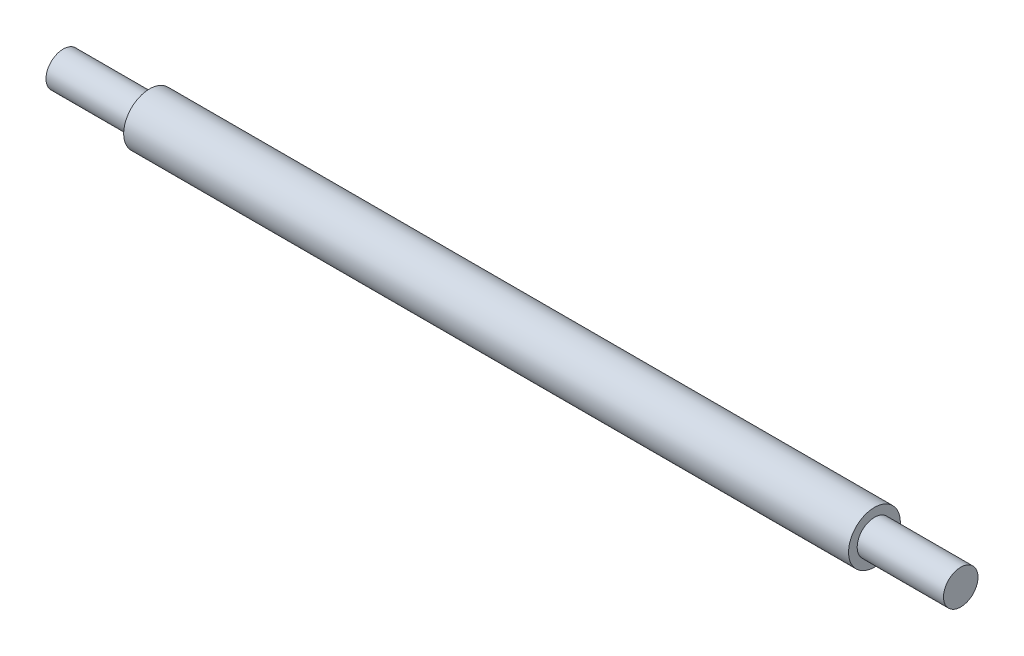
ISO-10303-21;
HEADER;
FILE_DESCRIPTION(('STEP AP214'),'2;1');
FILE_NAME('part.step','',(''),(''),'','','');
FILE_SCHEMA(('AUTOMOTIVE_DESIGN { 1 0 10303 214 1 1 1 1 }'));
ENDSEC;
DATA;
#1=APPLICATION_CONTEXT('core data for automotive mechanical design processes');
#2=APPLICATION_PROTOCOL_DEFINITION('international standard','automotive_design',2000,#1);
#3=PRODUCT_CONTEXT('',#1,'mechanical');
#4=PRODUCT('Part','Part','',(#3));
#5=PRODUCT_RELATED_PRODUCT_CATEGORY('part','',(#4));
#6=PRODUCT_DEFINITION_FORMATION('','',#4);
#7=PRODUCT_DEFINITION_CONTEXT('part definition',#1,'design');
#8=PRODUCT_DEFINITION('design','',#6,#7);
#9=PRODUCT_DEFINITION_SHAPE('','',#8);
#10=(LENGTH_UNIT() NAMED_UNIT(*) SI_UNIT(.MILLI.,.METRE.));
#11=(NAMED_UNIT(*) PLANE_ANGLE_UNIT() SI_UNIT($,.RADIAN.));
#12=(NAMED_UNIT(*) SI_UNIT($,.STERADIAN.) SOLID_ANGLE_UNIT());
#13=UNCERTAINTY_MEASURE_WITH_UNIT(LENGTH_MEASURE(1.E-05),#10,'distance_accuracy_value','');
#14=(GEOMETRIC_REPRESENTATION_CONTEXT(3) GLOBAL_UNCERTAINTY_ASSIGNED_CONTEXT((#13)) GLOBAL_UNIT_ASSIGNED_CONTEXT((#10,
#11,#12)) REPRESENTATION_CONTEXT('',''));
#15=CARTESIAN_POINT('',(0.,0.,0.));
#16=DIRECTION('',(0.,0.,1.));
#17=DIRECTION('',(1.,0.,0.));
#18=AXIS2_PLACEMENT_3D('',#15,#16,#17);
#19=CARTESIAN_POINT('',(-52.,0.,0.));
#20=DIRECTION('',(1.,0.,0.));
#21=DIRECTION('',(0.,1.,0.));
#22=AXIS2_PLACEMENT_3D('',#19,#20,#21);
#23=PLANE('',#22);
#24=CARTESIAN_POINT('',(-52.,0.,0.));
#25=DIRECTION('',(-1.,0.,0.));
#26=DIRECTION('',(0.,-1.,0.));
#27=AXIS2_PLACEMENT_3D('',#24,#25,#26);
#28=CIRCLE('',#27,2.);
#29=CARTESIAN_POINT('',(-52.,-2.00000000000002,0.));
#30=VERTEX_POINT('',#29);
#31=EDGE_CURVE('E10',#30,#30,#28,.T.);
#32=ORIENTED_EDGE('',*,*,#31,.T.);
#33=EDGE_LOOP('',(#32));
#34=FACE_BOUND('',#33,.T.);
#35=ADVANCED_FACE('F29',(#34),#23,.F.);
#36=CARTESIAN_POINT('',(-52.,0.,0.));
#37=DIRECTION('',(-1.,0.,0.));
#38=DIRECTION('',(0.,-1.,0.));
#39=AXIS2_PLACEMENT_3D('',#36,#37,#38);
#40=CYLINDRICAL_SURFACE('',#39,2.);
#41=ORIENTED_EDGE('',*,*,#31,.F.);
#42=EDGE_LOOP('',(#41));
#43=FACE_BOUND('',#42,.T.);
#44=CARTESIAN_POINT('',(-42.,0.,0.));
#45=DIRECTION('',(-1.,0.,0.));
#46=DIRECTION('',(0.,-1.,0.));
#47=AXIS2_PLACEMENT_3D('',#44,#45,#46);
#48=CIRCLE('',#47,2.);
#49=CARTESIAN_POINT('',(-42.,-2.00000000000002,0.));
#50=VERTEX_POINT('',#49);
#51=EDGE_CURVE('E35',#50,#50,#48,.T.);
#52=ORIENTED_EDGE('',*,*,#51,.T.);
#53=EDGE_LOOP('',(#52));
#54=FACE_BOUND('',#53,.T.);
#55=ADVANCED_FACE('F67',(#43,#54),#40,.T.);
#56=CARTESIAN_POINT('',(-42.,1.99999999999999,0.));
#57=DIRECTION('',(1.,0.,0.));
#58=DIRECTION('',(0.,1.,0.));
#59=AXIS2_PLACEMENT_3D('',#56,#57,#58);
#60=PLANE('',#59);
#61=ORIENTED_EDGE('',*,*,#51,.F.);
#62=EDGE_LOOP('',(#61));
#63=FACE_BOUND('',#62,.T.);
#64=CARTESIAN_POINT('',(-42.,0.,0.));
#65=DIRECTION('',(-1.,0.,0.));
#66=DIRECTION('',(0.,-1.,0.));
#67=AXIS2_PLACEMENT_3D('',#64,#65,#66);
#68=CIRCLE('',#67,3.);
#69=CARTESIAN_POINT('',(-42.,-3.00000000000002,0.));
#70=VERTEX_POINT('',#69);
#71=EDGE_CURVE('E39',#70,#70,#68,.T.);
#72=ORIENTED_EDGE('',*,*,#71,.T.);
#73=EDGE_LOOP('',(#72));
#74=FACE_BOUND('',#73,.T.);
#75=ADVANCED_FACE('F71',(#63,#74),#60,.F.);
#76=CARTESIAN_POINT('',(-52.,0.,0.));
#77=DIRECTION('',(-1.,0.,0.));
#78=DIRECTION('',(0.,-1.,0.));
#79=AXIS2_PLACEMENT_3D('',#76,#77,#78);
#80=CYLINDRICAL_SURFACE('',#79,3.);
#81=ORIENTED_EDGE('',*,*,#71,.F.);
#82=EDGE_LOOP('',(#81));
#83=FACE_BOUND('',#82,.T.);
#84=CARTESIAN_POINT('',(42.,0.,0.));
#85=DIRECTION('',(-1.,0.,0.));
#86=DIRECTION('',(0.,-1.,0.));
#87=AXIS2_PLACEMENT_3D('',#84,#85,#86);
#88=CIRCLE('',#87,3.);
#89=CARTESIAN_POINT('',(42.,-3.00000000000001,0.));
#90=VERTEX_POINT('',#89);
#91=EDGE_CURVE('E43',#90,#90,#88,.T.);
#92=ORIENTED_EDGE('',*,*,#91,.T.);
#93=EDGE_LOOP('',(#92));
#94=FACE_BOUND('',#93,.T.);
#95=ADVANCED_FACE('F76',(#83,#94),#80,.T.);
#96=CARTESIAN_POINT('',(42.,2.99999999999999,0.));
#97=DIRECTION('',(-1.,0.,0.));
#98=DIRECTION('',(0.,-1.,0.));
#99=AXIS2_PLACEMENT_3D('',#96,#97,#98);
#100=PLANE('',#99);
#101=ORIENTED_EDGE('',*,*,#91,.F.);
#102=EDGE_LOOP('',(#101));
#103=FACE_BOUND('',#102,.T.);
#104=CARTESIAN_POINT('',(42.,0.,0.));
#105=DIRECTION('',(-1.,0.,0.));
#106=DIRECTION('',(0.,-1.,0.));
#107=AXIS2_PLACEMENT_3D('',#104,#105,#106);
#108=CIRCLE('',#107,2.);
#109=CARTESIAN_POINT('',(42.,-2.00000000000001,0.));
#110=VERTEX_POINT('',#109);
#111=EDGE_CURVE('E48',#110,#110,#108,.T.);
#112=ORIENTED_EDGE('',*,*,#111,.T.);
#113=EDGE_LOOP('',(#112));
#114=FACE_BOUND('',#113,.T.);
#115=ADVANCED_FACE('F63',(#103,#114),#100,.F.);
#116=CARTESIAN_POINT('',(-52.,0.,0.));
#117=DIRECTION('',(-1.,0.,0.));
#118=DIRECTION('',(0.,-1.,0.));
#119=AXIS2_PLACEMENT_3D('',#116,#117,#118);
#120=CYLINDRICAL_SURFACE('',#119,2.);
#121=ORIENTED_EDGE('',*,*,#111,.F.);
#122=EDGE_LOOP('',(#121));
#123=FACE_BOUND('',#122,.T.);
#124=CARTESIAN_POINT('',(52.,0.,0.));
#125=DIRECTION('',(-1.,0.,0.));
#126=DIRECTION('',(0.,-1.,0.));
#127=AXIS2_PLACEMENT_3D('',#124,#125,#126);
#128=CIRCLE('',#127,2.);
#129=CARTESIAN_POINT('',(52.,-2.00000000000001,0.));
#130=VERTEX_POINT('',#129);
#131=EDGE_CURVE('E51',#130,#130,#128,.T.);
#132=ORIENTED_EDGE('',*,*,#131,.T.);
#133=EDGE_LOOP('',(#132));
#134=FACE_BOUND('',#133,.T.);
#135=ADVANCED_FACE('F55',(#123,#134),#120,.T.);
#136=CARTESIAN_POINT('',(52.,1.99999999999999,0.));
#137=DIRECTION('',(-1.,0.,0.));
#138=DIRECTION('',(0.,-1.,0.));
#139=AXIS2_PLACEMENT_3D('',#136,#137,#138);
#140=PLANE('',#139);
#141=ORIENTED_EDGE('',*,*,#131,.F.);
#142=EDGE_LOOP('',(#141));
#143=FACE_BOUND('',#142,.T.);
#144=ADVANCED_FACE('F57',(#143),#140,.F.);
#145=CLOSED_SHELL('',(#35,#55,#75,#95,#115,#135,#144));
#146=MANIFOLD_SOLID_BREP('B2',#145);
#147=ADVANCED_BREP_SHAPE_REPRESENTATION('',(#18,#146),#14);
#148=SHAPE_DEFINITION_REPRESENTATION(#9,#147);
ENDSEC;
END-ISO-10303-21;
